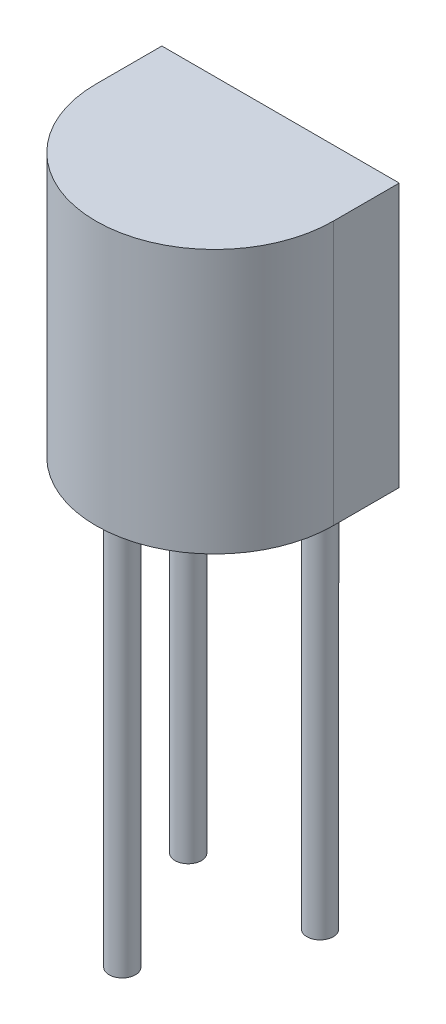
ISO-10303-21;
HEADER;
FILE_DESCRIPTION(('STEP AP214'),'2;1');
FILE_NAME('part.step','',(''),(''),'','','');
FILE_SCHEMA(('AUTOMOTIVE_DESIGN { 1 0 10303 214 1 1 1 1 }'));
ENDSEC;
DATA;
#1=APPLICATION_CONTEXT('core data for automotive mechanical design processes');
#2=APPLICATION_PROTOCOL_DEFINITION('international standard','automotive_design',2000,#1);
#3=PRODUCT_CONTEXT('',#1,'mechanical');
#4=PRODUCT('Part','Part','',(#3));
#5=PRODUCT_RELATED_PRODUCT_CATEGORY('part','',(#4));
#6=PRODUCT_DEFINITION_FORMATION('','',#4);
#7=PRODUCT_DEFINITION_CONTEXT('part definition',#1,'design');
#8=PRODUCT_DEFINITION('design','',#6,#7);
#9=PRODUCT_DEFINITION_SHAPE('','',#8);
#10=(LENGTH_UNIT() NAMED_UNIT(*) SI_UNIT(.MILLI.,.METRE.));
#11=(NAMED_UNIT(*) PLANE_ANGLE_UNIT() SI_UNIT($,.RADIAN.));
#12=(NAMED_UNIT(*) SI_UNIT($,.STERADIAN.) SOLID_ANGLE_UNIT());
#13=UNCERTAINTY_MEASURE_WITH_UNIT(LENGTH_MEASURE(1.E-05),#10,'distance_accuracy_value','');
#14=(GEOMETRIC_REPRESENTATION_CONTEXT(3) GLOBAL_UNCERTAINTY_ASSIGNED_CONTEXT((#13)) GLOBAL_UNIT_ASSIGNED_CONTEXT((#10,
#11,#12)) REPRESENTATION_CONTEXT('',''));
#15=CARTESIAN_POINT('',(0.,0.,0.));
#16=DIRECTION('',(0.,0.,1.));
#17=DIRECTION('',(1.,0.,0.));
#18=AXIS2_PLACEMENT_3D('',#15,#16,#17);
#19=CARTESIAN_POINT('',(2.25,0.,0.));
#20=DIRECTION('',(0.,1.,0.));
#21=DIRECTION('',(0.,0.,1.));
#22=AXIS2_PLACEMENT_3D('',#19,#20,#21);
#23=PLANE('',#22);
#24=CARTESIAN_POINT('',(3.5,0.,-0.75));
#25=DIRECTION('',(0.,1.,0.));
#26=DIRECTION('',(0.,0.,1.));
#27=AXIS2_PLACEMENT_3D('',#24,#25,#26);
#28=CIRCLE('',#27,0.25);
#29=CARTESIAN_POINT('',(3.5,0.,-0.5));
#30=VERTEX_POINT('',#29);
#31=EDGE_CURVE('E45',#30,#30,#28,.F.);
#32=ORIENTED_EDGE('',*,*,#31,.F.);
#33=EDGE_LOOP('',(#32));
#34=FACE_BOUND('',#33,.T.);
#35=CARTESIAN_POINT('',(2.25,0.,0.));
#36=DIRECTION('',(0.,1.,0.));
#37=DIRECTION('',(0.,0.,1.));
#38=AXIS2_PLACEMENT_3D('',#35,#36,#37);
#39=CIRCLE('',#38,2.25);
#40=CARTESIAN_POINT('',(0.,0.,0.));
#41=VERTEX_POINT('',#40);
#42=CARTESIAN_POINT('',(4.5,0.,0.));
#43=VERTEX_POINT('',#42);
#44=EDGE_CURVE('E104',#41,#43,#39,.T.);
#45=ORIENTED_EDGE('',*,*,#44,.F.);
#46=DIRECTION('',(0.,0.,1.));
#47=VECTOR('',#46,1.);
#48=CARTESIAN_POINT('',(0.,0.,-1.25));
#49=LINE('',#48,#47);
#50=CARTESIAN_POINT('',(0.,0.,-1.25));
#51=VERTEX_POINT('',#50);
#52=EDGE_CURVE('E76',#51,#41,#49,.T.);
#53=ORIENTED_EDGE('',*,*,#52,.F.);
#54=DIRECTION('',(-1.,0.,0.));
#55=VECTOR('',#54,1.);
#56=CARTESIAN_POINT('',(0.,0.,-1.25));
#57=LINE('',#56,#55);
#58=CARTESIAN_POINT('',(4.5,0.,-1.25));
#59=VERTEX_POINT('',#58);
#60=EDGE_CURVE('E70',#59,#51,#57,.T.);
#61=ORIENTED_EDGE('',*,*,#60,.F.);
#62=DIRECTION('',(0.,0.,-1.));
#63=VECTOR('',#62,1.);
#64=CARTESIAN_POINT('',(4.5,0.,0.));
#65=LINE('',#64,#63);
#66=EDGE_CURVE('E94',#43,#59,#65,.T.);
#67=ORIENTED_EDGE('',*,*,#66,.F.);
#68=EDGE_LOOP('',(#45,#53,#61,#67));
#69=FACE_BOUND('',#68,.T.);
#70=CARTESIAN_POINT('',(1.,0.,-0.75));
#71=DIRECTION('',(0.,1.,0.));
#72=DIRECTION('',(0.,0.,1.));
#73=AXIS2_PLACEMENT_3D('',#70,#71,#72);
#74=CIRCLE('',#73,0.25);
#75=CARTESIAN_POINT('',(1.,0.,-0.5));
#76=VERTEX_POINT('',#75);
#77=EDGE_CURVE('E114',#76,#76,#74,.F.);
#78=ORIENTED_EDGE('',*,*,#77,.F.);
#79=EDGE_LOOP('',(#78));
#80=FACE_BOUND('',#79,.T.);
#81=CARTESIAN_POINT('',(2.25,0.,1.75));
#82=DIRECTION('',(0.,1.,0.));
#83=DIRECTION('',(0.,0.,1.));
#84=AXIS2_PLACEMENT_3D('',#81,#82,#83);
#85=CIRCLE('',#84,0.25);
#86=CARTESIAN_POINT('',(2.25,0.,2.));
#87=VERTEX_POINT('',#86);
#88=EDGE_CURVE('E11',#87,#87,#85,.F.);
#89=ORIENTED_EDGE('',*,*,#88,.F.);
#90=EDGE_LOOP('',(#89));
#91=FACE_BOUND('',#90,.T.);
#92=ADVANCED_FACE('F36',(#34,#69,#80,#91),#23,.F.);
#93=CARTESIAN_POINT('',(2.25,5.,0.));
#94=DIRECTION('',(0.,-1.,0.));
#95=DIRECTION('',(0.,0.,-1.));
#96=AXIS2_PLACEMENT_3D('',#93,#94,#95);
#97=CYLINDRICAL_SURFACE('',#96,2.25);
#98=ORIENTED_EDGE('',*,*,#44,.T.);
#99=DIRECTION('',(0.,-1.,0.));
#100=VECTOR('',#99,1.);
#101=CARTESIAN_POINT('',(4.5,5.,0.));
#102=LINE('',#101,#100);
#103=CARTESIAN_POINT('',(4.5,5.,0.));
#104=VERTEX_POINT('',#103);
#105=EDGE_CURVE('E95',#104,#43,#102,.T.);
#106=ORIENTED_EDGE('',*,*,#105,.F.);
#107=CARTESIAN_POINT('',(2.25,5.,0.));
#108=DIRECTION('',(0.,1.,0.));
#109=DIRECTION('',(0.,0.,1.));
#110=AXIS2_PLACEMENT_3D('',#107,#108,#109);
#111=CIRCLE('',#110,2.25);
#112=CARTESIAN_POINT('',(0.,5.,0.));
#113=VERTEX_POINT('',#112);
#114=EDGE_CURVE('E89',#113,#104,#111,.T.);
#115=ORIENTED_EDGE('',*,*,#114,.F.);
#116=DIRECTION('',(0.,-1.,0.));
#117=VECTOR('',#116,1.);
#118=CARTESIAN_POINT('',(0.,5.,0.));
#119=LINE('',#118,#117);
#120=EDGE_CURVE('E100',#113,#41,#119,.T.);
#121=ORIENTED_EDGE('',*,*,#120,.T.);
#122=EDGE_LOOP('',(#98,#106,#115,#121));
#123=FACE_BOUND('',#122,.T.);
#124=ADVANCED_FACE('F38',(#123),#97,.T.);
#125=CARTESIAN_POINT('',(4.5,5.,0.));
#126=DIRECTION('',(-1.,0.,0.));
#127=DIRECTION('',(0.,0.,1.));
#128=AXIS2_PLACEMENT_3D('',#125,#126,#127);
#129=PLANE('',#128);
#130=ORIENTED_EDGE('',*,*,#66,.T.);
#131=DIRECTION('',(0.,-1.,0.));
#132=VECTOR('',#131,1.);
#133=CARTESIAN_POINT('',(4.5,5.,-1.25));
#134=LINE('',#133,#132);
#135=CARTESIAN_POINT('',(4.5,5.,-1.25));
#136=VERTEX_POINT('',#135);
#137=EDGE_CURVE('E92',#136,#59,#134,.T.);
#138=ORIENTED_EDGE('',*,*,#137,.F.);
#139=DIRECTION('',(0.,0.,-1.));
#140=VECTOR('',#139,1.);
#141=CARTESIAN_POINT('',(4.5,5.,0.));
#142=LINE('',#141,#140);
#143=EDGE_CURVE('E84',#104,#136,#142,.T.);
#144=ORIENTED_EDGE('',*,*,#143,.F.);
#145=ORIENTED_EDGE('',*,*,#105,.T.);
#146=EDGE_LOOP('',(#130,#138,#144,#145));
#147=FACE_BOUND('',#146,.T.);
#148=ADVANCED_FACE('F93',(#147),#129,.F.);
#149=CARTESIAN_POINT('',(0.,5.,-1.25));
#150=DIRECTION('',(0.,0.,1.));
#151=DIRECTION('',(1.,0.,0.));
#152=AXIS2_PLACEMENT_3D('',#149,#150,#151);
#153=PLANE('',#152);
#154=ORIENTED_EDGE('',*,*,#60,.T.);
#155=DIRECTION('',(0.,-1.,0.));
#156=VECTOR('',#155,1.);
#157=CARTESIAN_POINT('',(0.,5.,-1.25));
#158=LINE('',#157,#156);
#159=CARTESIAN_POINT('',(0.,5.,-1.25));
#160=VERTEX_POINT('',#159);
#161=EDGE_CURVE('E96',#160,#51,#158,.T.);
#162=ORIENTED_EDGE('',*,*,#161,.F.);
#163=DIRECTION('',(-1.,0.,0.));
#164=VECTOR('',#163,1.);
#165=CARTESIAN_POINT('',(0.,5.,-1.25));
#166=LINE('',#165,#164);
#167=EDGE_CURVE('E87',#136,#160,#166,.T.);
#168=ORIENTED_EDGE('',*,*,#167,.F.);
#169=ORIENTED_EDGE('',*,*,#137,.T.);
#170=EDGE_LOOP('',(#154,#162,#168,#169));
#171=FACE_BOUND('',#170,.T.);
#172=ADVANCED_FACE('F98',(#171),#153,.F.);
#173=CARTESIAN_POINT('',(0.,5.,-1.25));
#174=DIRECTION('',(1.,0.,0.));
#175=DIRECTION('',(0.,0.,-1.));
#176=AXIS2_PLACEMENT_3D('',#173,#174,#175);
#177=PLANE('',#176);
#178=ORIENTED_EDGE('',*,*,#52,.T.);
#179=ORIENTED_EDGE('',*,*,#120,.F.);
#180=DIRECTION('',(0.,0.,1.));
#181=VECTOR('',#180,1.);
#182=CARTESIAN_POINT('',(0.,5.,-1.25));
#183=LINE('',#182,#181);
#184=EDGE_CURVE('E53',#160,#113,#183,.T.);
#185=ORIENTED_EDGE('',*,*,#184,.F.);
#186=ORIENTED_EDGE('',*,*,#161,.T.);
#187=EDGE_LOOP('',(#178,#179,#185,#186));
#188=FACE_BOUND('',#187,.T.);
#189=ADVANCED_FACE('F158',(#188),#177,.F.);
#190=CARTESIAN_POINT('',(2.25,5.,0.));
#191=DIRECTION('',(0.,1.,0.));
#192=DIRECTION('',(0.,0.,1.));
#193=AXIS2_PLACEMENT_3D('',#190,#191,#192);
#194=PLANE('',#193);
#195=ORIENTED_EDGE('',*,*,#114,.T.);
#196=ORIENTED_EDGE('',*,*,#143,.T.);
#197=ORIENTED_EDGE('',*,*,#167,.T.);
#198=ORIENTED_EDGE('',*,*,#184,.T.);
#199=EDGE_LOOP('',(#195,#196,#197,#198));
#200=FACE_BOUND('',#199,.T.);
#201=ADVANCED_FACE('F85',(#200),#194,.T.);
#202=CARTESIAN_POINT('',(1.,-7.5,-0.75));
#203=DIRECTION('',(0.,1.,0.));
#204=DIRECTION('',(0.,0.,1.));
#205=AXIS2_PLACEMENT_3D('',#202,#203,#204);
#206=CYLINDRICAL_SURFACE('',#205,0.25);
#207=CARTESIAN_POINT('',(1.,-7.5,-0.75));
#208=DIRECTION('',(0.,-1.,0.));
#209=DIRECTION('',(0.,0.,-1.));
#210=AXIS2_PLACEMENT_3D('',#207,#208,#209);
#211=CIRCLE('',#210,0.25);
#212=CARTESIAN_POINT('',(1.,-7.5,-1.));
#213=VERTEX_POINT('',#212);
#214=EDGE_CURVE('E107',#213,#213,#211,.T.);
#215=ORIENTED_EDGE('',*,*,#214,.F.);
#216=EDGE_LOOP('',(#215));
#217=FACE_BOUND('',#216,.T.);
#218=ORIENTED_EDGE('',*,*,#77,.T.);
#219=EDGE_LOOP('',(#218));
#220=FACE_BOUND('',#219,.T.);
#221=ADVANCED_FACE('F152',(#217,#220),#206,.T.);
#222=CARTESIAN_POINT('',(1.,-7.5,-0.75));
#223=DIRECTION('',(0.,-1.,0.));
#224=DIRECTION('',(0.,0.,-1.));
#225=AXIS2_PLACEMENT_3D('',#222,#223,#224);
#226=PLANE('',#225);
#227=ORIENTED_EDGE('',*,*,#214,.T.);
#228=EDGE_LOOP('',(#227));
#229=FACE_BOUND('',#228,.T.);
#230=ADVANCED_FACE('F148',(#229),#226,.T.);
#231=CARTESIAN_POINT('',(3.5,-7.5,-0.75));
#232=DIRECTION('',(0.,1.,0.));
#233=DIRECTION('',(0.,0.,1.));
#234=AXIS2_PLACEMENT_3D('',#231,#232,#233);
#235=CYLINDRICAL_SURFACE('',#234,0.25);
#236=CARTESIAN_POINT('',(3.5,-7.5,-0.75));
#237=DIRECTION('',(0.,-1.,0.));
#238=DIRECTION('',(0.,0.,-1.));
#239=AXIS2_PLACEMENT_3D('',#236,#237,#238);
#240=CIRCLE('',#239,0.25);
#241=CARTESIAN_POINT('',(3.5,-7.5,-1.));
#242=VERTEX_POINT('',#241);
#243=EDGE_CURVE('E173',#242,#242,#240,.T.);
#244=ORIENTED_EDGE('',*,*,#243,.F.);
#245=EDGE_LOOP('',(#244));
#246=FACE_BOUND('',#245,.T.);
#247=ORIENTED_EDGE('',*,*,#31,.T.);
#248=EDGE_LOOP('',(#247));
#249=FACE_BOUND('',#248,.T.);
#250=ADVANCED_FACE('F119',(#246,#249),#235,.T.);
#251=CARTESIAN_POINT('',(3.5,-7.5,-0.75));
#252=DIRECTION('',(0.,-1.,0.));
#253=DIRECTION('',(0.,0.,-1.));
#254=AXIS2_PLACEMENT_3D('',#251,#252,#253);
#255=PLANE('',#254);
#256=ORIENTED_EDGE('',*,*,#243,.T.);
#257=EDGE_LOOP('',(#256));
#258=FACE_BOUND('',#257,.T.);
#259=ADVANCED_FACE('F133',(#258),#255,.T.);
#260=CARTESIAN_POINT('',(2.25,-7.5,1.75));
#261=DIRECTION('',(0.,1.,0.));
#262=DIRECTION('',(0.,0.,1.));
#263=AXIS2_PLACEMENT_3D('',#260,#261,#262);
#264=CYLINDRICAL_SURFACE('',#263,0.25);
#265=CARTESIAN_POINT('',(2.25,-7.5,1.75));
#266=DIRECTION('',(0.,-1.,0.));
#267=DIRECTION('',(0.,0.,-1.));
#268=AXIS2_PLACEMENT_3D('',#265,#266,#267);
#269=CIRCLE('',#268,0.25);
#270=CARTESIAN_POINT('',(2.25,-7.5,1.5));
#271=VERTEX_POINT('',#270);
#272=EDGE_CURVE('E176',#271,#271,#269,.T.);
#273=ORIENTED_EDGE('',*,*,#272,.F.);
#274=EDGE_LOOP('',(#273));
#275=FACE_BOUND('',#274,.T.);
#276=ORIENTED_EDGE('',*,*,#88,.T.);
#277=EDGE_LOOP('',(#276));
#278=FACE_BOUND('',#277,.T.);
#279=ADVANCED_FACE('F130',(#275,#278),#264,.T.);
#280=CARTESIAN_POINT('',(2.25,-7.5,1.75));
#281=DIRECTION('',(0.,-1.,0.));
#282=DIRECTION('',(0.,0.,-1.));
#283=AXIS2_PLACEMENT_3D('',#280,#281,#282);
#284=PLANE('',#283);
#285=ORIENTED_EDGE('',*,*,#272,.T.);
#286=EDGE_LOOP('',(#285));
#287=FACE_BOUND('',#286,.T.);
#288=ADVANCED_FACE('F132',(#287),#284,.T.);
#289=CLOSED_SHELL('',(#92,#124,#148,#172,#189,#201,#221,#230,#250,#259,#279,#288));
#290=MANIFOLD_SOLID_BREP('B2',#289);
#291=ADVANCED_BREP_SHAPE_REPRESENTATION('',(#18,#290),#14);
#292=SHAPE_DEFINITION_REPRESENTATION(#9,#291);
ENDSEC;
END-ISO-10303-21;
